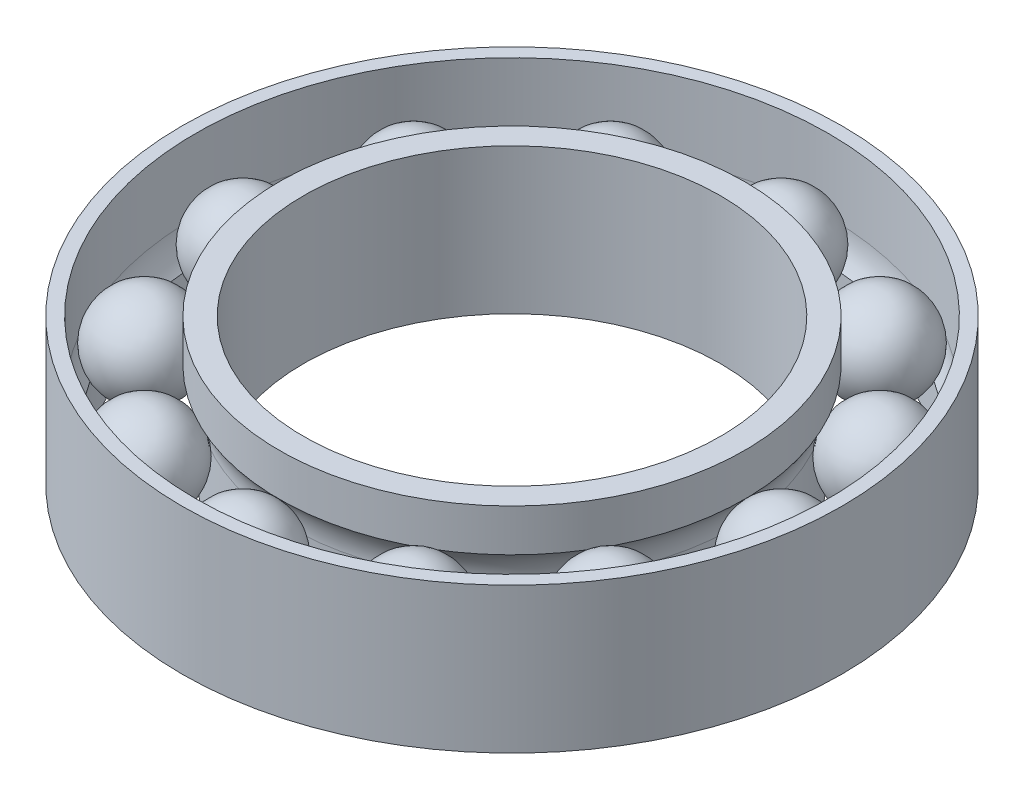
ISO-10303-21;
HEADER;
FILE_DESCRIPTION(('STEP AP214'),'2;1');
FILE_NAME('part.step','',(''),(''),'','','');
FILE_SCHEMA(('AUTOMOTIVE_DESIGN { 1 0 10303 214 1 1 1 1 }'));
ENDSEC;
DATA;
#1=APPLICATION_CONTEXT('core data for automotive mechanical design processes');
#2=APPLICATION_PROTOCOL_DEFINITION('international standard','automotive_design',2000,#1);
#3=PRODUCT_CONTEXT('',#1,'mechanical');
#4=PRODUCT('Part','Part','',(#3));
#5=PRODUCT_RELATED_PRODUCT_CATEGORY('part','',(#4));
#6=PRODUCT_DEFINITION_FORMATION('','',#4);
#7=PRODUCT_DEFINITION_CONTEXT('part definition',#1,'design');
#8=PRODUCT_DEFINITION('design','',#6,#7);
#9=PRODUCT_DEFINITION_SHAPE('','',#8);
#10=(LENGTH_UNIT() NAMED_UNIT(*) SI_UNIT(.MILLI.,.METRE.));
#11=(NAMED_UNIT(*) PLANE_ANGLE_UNIT() SI_UNIT($,.RADIAN.));
#12=(NAMED_UNIT(*) SI_UNIT($,.STERADIAN.) SOLID_ANGLE_UNIT());
#13=UNCERTAINTY_MEASURE_WITH_UNIT(LENGTH_MEASURE(1.E-05),#10,'distance_accuracy_value','');
#14=(GEOMETRIC_REPRESENTATION_CONTEXT(3) GLOBAL_UNCERTAINTY_ASSIGNED_CONTEXT((#13)) GLOBAL_UNIT_ASSIGNED_CONTEXT((#10,
#11,#12)) REPRESENTATION_CONTEXT('',''));
#15=CARTESIAN_POINT('',(0.,0.,0.));
#16=DIRECTION('',(0.,0.,1.));
#17=DIRECTION('',(1.,0.,0.));
#18=AXIS2_PLACEMENT_3D('',#15,#16,#17);
#19=CARTESIAN_POINT('',(4.80644099100367,1.5,-2.77499999999994));
#20=DIRECTION('',(0.,-1.,0.));
#21=DIRECTION('',(-0.866025403784445,0.,0.499999999999989));
#22=AXIS2_PLACEMENT_3D('',#19,#20,#21);
#23=SPHERICAL_SURFACE('',#22,0.975);
#24=CARTESIAN_POINT('',(4.80644099100367,0.524999999999999,-2.77499999999994));
#25=VERTEX_POINT('',#24);
#26=VERTEX_LOOP('',#25);
#27=FACE_BOUND('',#26,.T.);
#28=ADVANCED_FACE('F44',(#27),#23,.T.);
#29=CLOSED_SHELL('',(#28));
#30=MANIFOLD_SOLID_BREP('B2',#29);
#31=CARTESIAN_POINT('',(2.77500000000006,1.5,-4.8064409910036));
#32=DIRECTION('',(0.,-1.,0.));
#33=DIRECTION('',(-0.50000000000001,0.,0.866025403784433));
#34=AXIS2_PLACEMENT_3D('',#31,#32,#33);
#35=SPHERICAL_SURFACE('',#34,0.975);
#36=CARTESIAN_POINT('',(2.77500000000006,0.524999999999999,-4.8064409910036));
#37=VERTEX_POINT('',#36);
#38=VERTEX_LOOP('',#37);
#39=FACE_BOUND('',#38,.T.);
#40=ADVANCED_FACE('F63',(#39),#35,.T.);
#41=CLOSED_SHELL('',(#40));
#42=MANIFOLD_SOLID_BREP('B6',#41);
#43=CARTESIAN_POINT('',(0.,1.5,-5.55));
#44=DIRECTION('',(0.,-1.,0.));
#45=DIRECTION('',(0.,0.,1.));
#46=AXIS2_PLACEMENT_3D('',#43,#44,#45);
#47=SPHERICAL_SURFACE('',#46,0.975);
#48=CARTESIAN_POINT('',(0.,0.524999999999999,-5.55));
#49=VERTEX_POINT('',#48);
#50=VERTEX_LOOP('',#49);
#51=FACE_BOUND('',#50,.T.);
#52=ADVANCED_FACE('F82',(#51),#47,.T.);
#53=CLOSED_SHELL('',(#52));
#54=MANIFOLD_SOLID_BREP('B40',#53);
#55=CARTESIAN_POINT('',(-2.77499999999996,1.5,-4.80644099100366));
#56=DIRECTION('',(0.,-1.,0.));
#57=DIRECTION('',(0.499999999999992,0.,0.866025403784443));
#58=AXIS2_PLACEMENT_3D('',#55,#56,#57);
#59=SPHERICAL_SURFACE('',#58,0.975);
#60=CARTESIAN_POINT('',(-2.77499999999996,0.524999999999999,-4.80644099100366));
#61=VERTEX_POINT('',#60);
#62=VERTEX_LOOP('',#61);
#63=FACE_BOUND('',#62,.T.);
#64=ADVANCED_FACE('F101',(#63),#59,.T.);
#65=CLOSED_SHELL('',(#64));
#66=MANIFOLD_SOLID_BREP('B59',#65);
#67=CARTESIAN_POINT('',(-4.80644099100361,1.5,-2.77500000000004));
#68=DIRECTION('',(0.,-1.,0.));
#69=DIRECTION('',(0.866025403784435,0.,0.500000000000007));
#70=AXIS2_PLACEMENT_3D('',#67,#68,#69);
#71=SPHERICAL_SURFACE('',#70,0.975);
#72=CARTESIAN_POINT('',(-4.80644099100361,0.524999999999999,-2.77500000000004));
#73=VERTEX_POINT('',#72);
#74=VERTEX_LOOP('',#73);
#75=FACE_BOUND('',#74,.T.);
#76=ADVANCED_FACE('F120',(#75),#71,.T.);
#77=CLOSED_SHELL('',(#76));
#78=MANIFOLD_SOLID_BREP('B78',#77);
#79=CARTESIAN_POINT('',(-5.55,1.5,0.));
#80=DIRECTION('',(0.,-1.,0.));
#81=DIRECTION('',(1.,0.,0.));
#82=AXIS2_PLACEMENT_3D('',#79,#80,#81);
#83=SPHERICAL_SURFACE('',#82,0.975);
#84=CARTESIAN_POINT('',(-5.55,0.524999999999999,0.));
#85=VERTEX_POINT('',#84);
#86=VERTEX_LOOP('',#85);
#87=FACE_BOUND('',#86,.T.);
#88=ADVANCED_FACE('F139',(#87),#83,.T.);
#89=CLOSED_SHELL('',(#88));
#90=MANIFOLD_SOLID_BREP('B97',#89);
#91=CARTESIAN_POINT('',(-4.80644099100365,1.5,2.77499999999997));
#92=DIRECTION('',(0.,-1.,0.));
#93=DIRECTION('',(0.866025403784442,0.,-0.499999999999995));
#94=AXIS2_PLACEMENT_3D('',#91,#92,#93);
#95=SPHERICAL_SURFACE('',#94,0.975);
#96=CARTESIAN_POINT('',(-4.80644099100365,0.524999999999999,2.77499999999997));
#97=VERTEX_POINT('',#96);
#98=VERTEX_LOOP('',#97);
#99=FACE_BOUND('',#98,.T.);
#100=ADVANCED_FACE('F158',(#99),#95,.T.);
#101=CLOSED_SHELL('',(#100));
#102=MANIFOLD_SOLID_BREP('B116',#101);
#103=CARTESIAN_POINT('',(-2.77500000000002,1.5,4.80644099100362));
#104=DIRECTION('',(0.,-1.,0.));
#105=DIRECTION('',(0.500000000000004,0.,-0.866025403784436));
#106=AXIS2_PLACEMENT_3D('',#103,#104,#105);
#107=SPHERICAL_SURFACE('',#106,0.975);
#108=CARTESIAN_POINT('',(-2.77500000000002,0.524999999999999,4.80644099100362));
#109=VERTEX_POINT('',#108);
#110=VERTEX_LOOP('',#109);
#111=FACE_BOUND('',#110,.T.);
#112=ADVANCED_FACE('F177',(#111),#107,.T.);
#113=CLOSED_SHELL('',(#112));
#114=MANIFOLD_SOLID_BREP('B135',#113);
#115=CARTESIAN_POINT('',(0.,1.5,5.55));
#116=DIRECTION('',(0.,-1.,0.));
#117=DIRECTION('',(0.,0.,-1.));
#118=AXIS2_PLACEMENT_3D('',#115,#116,#117);
#119=SPHERICAL_SURFACE('',#118,0.975);
#120=CARTESIAN_POINT('',(0.,0.524999999999999,5.55));
#121=VERTEX_POINT('',#120);
#122=VERTEX_LOOP('',#121);
#123=FACE_BOUND('',#122,.T.);
#124=ADVANCED_FACE('F196',(#123),#119,.T.);
#125=CLOSED_SHELL('',(#124));
#126=MANIFOLD_SOLID_BREP('B154',#125);
#127=CARTESIAN_POINT('',(2.77499999999999,1.5,4.80644099100364));
#128=DIRECTION('',(0.,-1.,0.));
#129=DIRECTION('',(-0.499999999999998,0.,-0.86602540378444));
#130=AXIS2_PLACEMENT_3D('',#127,#128,#129);
#131=SPHERICAL_SURFACE('',#130,0.975);
#132=CARTESIAN_POINT('',(2.77499999999999,0.524999999999999,4.80644099100364));
#133=VERTEX_POINT('',#132);
#134=VERTEX_LOOP('',#133);
#135=FACE_BOUND('',#134,.T.);
#136=ADVANCED_FACE('F215',(#135),#131,.T.);
#137=CLOSED_SHELL('',(#136));
#138=MANIFOLD_SOLID_BREP('B173',#137);
#139=CARTESIAN_POINT('',(4.80644099100363,1.5,2.77500000000001));
#140=DIRECTION('',(0.,-1.,0.));
#141=DIRECTION('',(-0.866025403784438,0.,-0.500000000000001));
#142=AXIS2_PLACEMENT_3D('',#139,#140,#141);
#143=SPHERICAL_SURFACE('',#142,0.975);
#144=CARTESIAN_POINT('',(4.80644099100363,0.524999999999999,2.77500000000001));
#145=VERTEX_POINT('',#144);
#146=VERTEX_LOOP('',#145);
#147=FACE_BOUND('',#146,.T.);
#148=ADVANCED_FACE('F234',(#147),#143,.T.);
#149=CLOSED_SHELL('',(#148));
#150=MANIFOLD_SOLID_BREP('B192',#149);
#151=CARTESIAN_POINT('',(5.55,1.5,0.));
#152=DIRECTION('',(0.,-1.,0.));
#153=DIRECTION('',(-1.,0.,0.));
#154=AXIS2_PLACEMENT_3D('',#151,#152,#153);
#155=SPHERICAL_SURFACE('',#154,0.975);
#156=CARTESIAN_POINT('',(5.55,0.524999999999999,0.));
#157=VERTEX_POINT('',#156);
#158=VERTEX_LOOP('',#157);
#159=FACE_BOUND('',#158,.T.);
#160=ADVANCED_FACE('F255',(#159),#155,.T.);
#161=CLOSED_SHELL('',(#160));
#162=MANIFOLD_SOLID_BREP('B211',#161);
#163=CARTESIAN_POINT('',(6.3,0.,0.));
#164=DIRECTION('',(0.,-1.,0.));
#165=DIRECTION('',(0.,0.,-1.));
#166=AXIS2_PLACEMENT_3D('',#163,#164,#165);
#167=PLANE('',#166);
#168=CARTESIAN_POINT('',(0.,0.,0.));
#169=DIRECTION('',(0.,-1.,0.));
#170=DIRECTION('',(0.,0.,-1.));
#171=AXIS2_PLACEMENT_3D('',#168,#169,#170);
#172=CIRCLE('',#171,6.8);
#173=CARTESIAN_POINT('',(0.,0.,-6.8));
#174=VERTEX_POINT('',#173);
#175=EDGE_CURVE('E254',#174,#174,#172,.T.);
#176=ORIENTED_EDGE('',*,*,#175,.T.);
#177=EDGE_LOOP('',(#176));
#178=FACE_BOUND('',#177,.T.);
#179=CARTESIAN_POINT('',(0.,0.,0.));
#180=DIRECTION('',(0.,-1.,0.));
#181=DIRECTION('',(0.,0.,-1.));
#182=AXIS2_PLACEMENT_3D('',#179,#180,#181);
#183=CIRCLE('',#182,6.3);
#184=CARTESIAN_POINT('',(0.,0.,-6.3));
#185=VERTEX_POINT('',#184);
#186=EDGE_CURVE('E302',#185,#185,#183,.T.);
#187=ORIENTED_EDGE('',*,*,#186,.F.);
#188=EDGE_LOOP('',(#187));
#189=FACE_BOUND('',#188,.T.);
#190=ADVANCED_FACE('F275',(#178,#189),#167,.T.);
#191=CARTESIAN_POINT('',(0.,3.,0.));
#192=DIRECTION('',(0.,-1.,0.));
#193=DIRECTION('',(0.,0.,-1.));
#194=AXIS2_PLACEMENT_3D('',#191,#192,#193);
#195=CYLINDRICAL_SURFACE('',#194,6.8);
#196=CARTESIAN_POINT('',(0.,3.,0.));
#197=DIRECTION('',(0.,-1.,0.));
#198=DIRECTION('',(0.,0.,-1.));
#199=AXIS2_PLACEMENT_3D('',#196,#197,#198);
#200=CIRCLE('',#199,6.8);
#201=CARTESIAN_POINT('',(0.,3.,-6.8));
#202=VERTEX_POINT('',#201);
#203=EDGE_CURVE('E282',#202,#202,#200,.T.);
#204=ORIENTED_EDGE('',*,*,#203,.T.);
#205=EDGE_LOOP('',(#204));
#206=FACE_BOUND('',#205,.T.);
#207=ORIENTED_EDGE('',*,*,#175,.F.);
#208=EDGE_LOOP('',(#207));
#209=FACE_BOUND('',#208,.T.);
#210=ADVANCED_FACE('F311',(#206,#209),#195,.T.);
#211=CARTESIAN_POINT('',(6.8,3.,0.));
#212=DIRECTION('',(0.,1.,0.));
#213=DIRECTION('',(0.,0.,1.));
#214=AXIS2_PLACEMENT_3D('',#211,#212,#213);
#215=PLANE('',#214);
#216=CARTESIAN_POINT('',(0.,3.,0.));
#217=DIRECTION('',(0.,-1.,0.));
#218=DIRECTION('',(0.,0.,-1.));
#219=AXIS2_PLACEMENT_3D('',#216,#217,#218);
#220=CIRCLE('',#219,6.525);
#221=CARTESIAN_POINT('',(0.,3.,-6.525));
#222=VERTEX_POINT('',#221);
#223=EDGE_CURVE('E287',#222,#222,#220,.T.);
#224=ORIENTED_EDGE('',*,*,#223,.T.);
#225=EDGE_LOOP('',(#224));
#226=FACE_BOUND('',#225,.T.);
#227=ORIENTED_EDGE('',*,*,#203,.F.);
#228=EDGE_LOOP('',(#227));
#229=FACE_BOUND('',#228,.T.);
#230=ADVANCED_FACE('F315',(#226,#229),#215,.T.);
#231=CARTESIAN_POINT('',(0.,3.,0.));
#232=DIRECTION('',(0.,-1.,0.));
#233=DIRECTION('',(0.,0.,-1.));
#234=AXIS2_PLACEMENT_3D('',#231,#232,#233);
#235=CYLINDRICAL_SURFACE('',#234,6.525);
#236=CARTESIAN_POINT('',(0.,1.5049242264469,0.));
#237=DIRECTION('',(0.,-1.,0.));
#238=DIRECTION('',(0.,0.,-1.));
#239=AXIS2_PLACEMENT_3D('',#236,#237,#238);
#240=CIRCLE('',#239,6.525);
#241=CARTESIAN_POINT('',(0.,1.5049242264469,-6.525));
#242=VERTEX_POINT('',#241);
#243=EDGE_CURVE('E292',#242,#242,#240,.T.);
#244=ORIENTED_EDGE('',*,*,#243,.T.);
#245=EDGE_LOOP('',(#244));
#246=FACE_BOUND('',#245,.T.);
#247=ORIENTED_EDGE('',*,*,#223,.F.);
#248=EDGE_LOOP('',(#247));
#249=FACE_BOUND('',#248,.T.);
#250=ADVANCED_FACE('F319',(#246,#249),#235,.F.);
#251=CARTESIAN_POINT('',(0.,1.5049242264469,0.));
#252=DIRECTION('',(0.,-1.,0.));
#253=DIRECTION('',(0.,0.,-1.));
#254=AXIS2_PLACEMENT_3D('',#251,#252,#253);
#255=TOROIDAL_SURFACE('',#254,5.55,0.975);
#256=CARTESIAN_POINT('',(0.,0.881927436728043,0.));
#257=DIRECTION('',(0.,-1.,0.));
#258=DIRECTION('',(0.,0.,-1.));
#259=AXIS2_PLACEMENT_3D('',#256,#257,#258);
#260=CIRCLE('',#259,6.3);
#261=CARTESIAN_POINT('',(0.,0.881927436728043,-6.3));
#262=VERTEX_POINT('',#261);
#263=EDGE_CURVE('E298',#262,#262,#260,.T.);
#264=ORIENTED_EDGE('',*,*,#263,.T.);
#265=EDGE_LOOP('',(#264));
#266=FACE_BOUND('',#265,.T.);
#267=ORIENTED_EDGE('',*,*,#243,.F.);
#268=EDGE_LOOP('',(#267));
#269=FACE_BOUND('',#268,.T.);
#270=ADVANCED_FACE('F326',(#266,#269),#255,.F.);
#271=CARTESIAN_POINT('',(0.,3.,0.));
#272=DIRECTION('',(0.,-1.,0.));
#273=DIRECTION('',(0.,0.,-1.));
#274=AXIS2_PLACEMENT_3D('',#271,#272,#273);
#275=CYLINDRICAL_SURFACE('',#274,6.3);
#276=ORIENTED_EDGE('',*,*,#186,.T.);
#277=EDGE_LOOP('',(#276));
#278=FACE_BOUND('',#277,.T.);
#279=ORIENTED_EDGE('',*,*,#263,.F.);
#280=EDGE_LOOP('',(#279));
#281=FACE_BOUND('',#280,.T.);
#282=ADVANCED_FACE('F307',(#278,#281),#275,.F.);
#283=CLOSED_SHELL('',(#190,#210,#230,#250,#270,#282));
#284=MANIFOLD_SOLID_BREP('B230',#283);
#285=CARTESIAN_POINT('',(4.8,3.,0.));
#286=DIRECTION('',(0.,1.,0.));
#287=DIRECTION('',(0.,0.,1.));
#288=AXIS2_PLACEMENT_3D('',#285,#286,#287);
#289=PLANE('',#288);
#290=CARTESIAN_POINT('',(0.,3.,0.));
#291=DIRECTION('',(0.,-1.,0.));
#292=DIRECTION('',(0.,0.,-1.));
#293=AXIS2_PLACEMENT_3D('',#290,#291,#292);
#294=CIRCLE('',#293,4.3);
#295=CARTESIAN_POINT('',(0.,3.,-4.3));
#296=VERTEX_POINT('',#295);
#297=EDGE_CURVE('E274',#296,#296,#294,.T.);
#298=ORIENTED_EDGE('',*,*,#297,.T.);
#299=EDGE_LOOP('',(#298));
#300=FACE_BOUND('',#299,.T.);
#301=CARTESIAN_POINT('',(0.,3.,0.));
#302=DIRECTION('',(0.,-1.,0.));
#303=DIRECTION('',(0.,0.,-1.));
#304=AXIS2_PLACEMENT_3D('',#301,#302,#303);
#305=CIRCLE('',#304,4.8);
#306=CARTESIAN_POINT('',(0.,3.,-4.8));
#307=VERTEX_POINT('',#306);
#308=EDGE_CURVE('E395',#307,#307,#305,.T.);
#309=ORIENTED_EDGE('',*,*,#308,.F.);
#310=EDGE_LOOP('',(#309));
#311=FACE_BOUND('',#310,.T.);
#312=ADVANCED_FACE('F373',(#300,#311),#289,.T.);
#313=CARTESIAN_POINT('',(0.,3.,0.));
#314=DIRECTION('',(0.,-1.,0.));
#315=DIRECTION('',(0.,0.,-1.));
#316=AXIS2_PLACEMENT_3D('',#313,#314,#315);
#317=CYLINDRICAL_SURFACE('',#316,4.3);
#318=CARTESIAN_POINT('',(0.,0.,0.));
#319=DIRECTION('',(0.,-1.,0.));
#320=DIRECTION('',(0.,0.,-1.));
#321=AXIS2_PLACEMENT_3D('',#318,#319,#320);
#322=CIRCLE('',#321,4.3);
#323=CARTESIAN_POINT('',(0.,0.,-4.3));
#324=VERTEX_POINT('',#323);
#325=EDGE_CURVE('E379',#324,#324,#322,.T.);
#326=ORIENTED_EDGE('',*,*,#325,.T.);
#327=EDGE_LOOP('',(#326));
#328=FACE_BOUND('',#327,.T.);
#329=ORIENTED_EDGE('',*,*,#297,.F.);
#330=EDGE_LOOP('',(#329));
#331=FACE_BOUND('',#330,.T.);
#332=ADVANCED_FACE('F403',(#328,#331),#317,.F.);
#333=CARTESIAN_POINT('',(4.3,0.,0.));
#334=DIRECTION('',(0.,-1.,0.));
#335=DIRECTION('',(0.,0.,-1.));
#336=AXIS2_PLACEMENT_3D('',#333,#334,#335);
#337=PLANE('',#336);
#338=CARTESIAN_POINT('',(0.,0.,0.));
#339=DIRECTION('',(0.,-1.,0.));
#340=DIRECTION('',(0.,0.,-1.));
#341=AXIS2_PLACEMENT_3D('',#338,#339,#340);
#342=CIRCLE('',#341,4.575);
#343=CARTESIAN_POINT('',(0.,0.,-4.575));
#344=VERTEX_POINT('',#343);
#345=EDGE_CURVE('E383',#344,#344,#342,.T.);
#346=ORIENTED_EDGE('',*,*,#345,.T.);
#347=EDGE_LOOP('',(#346));
#348=FACE_BOUND('',#347,.T.);
#349=ORIENTED_EDGE('',*,*,#325,.F.);
#350=EDGE_LOOP('',(#349));
#351=FACE_BOUND('',#350,.T.);
#352=ADVANCED_FACE('F407',(#348,#351),#337,.T.);
#353=CARTESIAN_POINT('',(0.,3.,0.));
#354=DIRECTION('',(0.,-1.,0.));
#355=DIRECTION('',(0.,0.,-1.));
#356=AXIS2_PLACEMENT_3D('',#353,#354,#355);
#357=CYLINDRICAL_SURFACE('',#356,4.575);
#358=CARTESIAN_POINT('',(0.,1.5049242264469,0.));
#359=DIRECTION('',(0.,-1.,0.));
#360=DIRECTION('',(0.,0.,-1.));
#361=AXIS2_PLACEMENT_3D('',#358,#359,#360);
#362=CIRCLE('',#361,4.575);
#363=CARTESIAN_POINT('',(0.,1.5049242264469,-4.575));
#364=VERTEX_POINT('',#363);
#365=EDGE_CURVE('E387',#364,#364,#362,.T.);
#366=ORIENTED_EDGE('',*,*,#365,.T.);
#367=EDGE_LOOP('',(#366));
#368=FACE_BOUND('',#367,.T.);
#369=ORIENTED_EDGE('',*,*,#345,.F.);
#370=EDGE_LOOP('',(#369));
#371=FACE_BOUND('',#370,.T.);
#372=ADVANCED_FACE('F411',(#368,#371),#357,.T.);
#373=CARTESIAN_POINT('',(0.,1.5049242264469,0.));
#374=DIRECTION('',(0.,-1.,0.));
#375=DIRECTION('',(0.,0.,-1.));
#376=AXIS2_PLACEMENT_3D('',#373,#374,#375);
#377=TOROIDAL_SURFACE('',#376,5.55,0.975);
#378=CARTESIAN_POINT('',(0.,2.12792101616576,0.));
#379=DIRECTION('',(0.,-1.,0.));
#380=DIRECTION('',(0.,0.,-1.));
#381=AXIS2_PLACEMENT_3D('',#378,#379,#380);
#382=CIRCLE('',#381,4.8);
#383=CARTESIAN_POINT('',(0.,2.12792101616576,-4.8));
#384=VERTEX_POINT('',#383);
#385=EDGE_CURVE('E392',#384,#384,#382,.T.);
#386=ORIENTED_EDGE('',*,*,#385,.T.);
#387=EDGE_LOOP('',(#386));
#388=FACE_BOUND('',#387,.T.);
#389=ORIENTED_EDGE('',*,*,#365,.F.);
#390=EDGE_LOOP('',(#389));
#391=FACE_BOUND('',#390,.T.);
#392=ADVANCED_FACE('F418',(#388,#391),#377,.F.);
#393=CARTESIAN_POINT('',(0.,3.,0.));
#394=DIRECTION('',(0.,-1.,0.));
#395=DIRECTION('',(0.,0.,-1.));
#396=AXIS2_PLACEMENT_3D('',#393,#394,#395);
#397=CYLINDRICAL_SURFACE('',#396,4.8);
#398=ORIENTED_EDGE('',*,*,#308,.T.);
#399=EDGE_LOOP('',(#398));
#400=FACE_BOUND('',#399,.T.);
#401=ORIENTED_EDGE('',*,*,#385,.F.);
#402=EDGE_LOOP('',(#401));
#403=FACE_BOUND('',#402,.T.);
#404=ADVANCED_FACE('F399',(#400,#403),#397,.T.);
#405=CLOSED_SHELL('',(#312,#332,#352,#372,#392,#404));
#406=MANIFOLD_SOLID_BREP('B249',#405);
#407=ADVANCED_BREP_SHAPE_REPRESENTATION('',(#18,#30,#42,#54,#66,#78,#90,#102,#114,#126,#138,
#150,#162,#284,#406),#14);
#408=SHAPE_DEFINITION_REPRESENTATION(#9,#407);
ENDSEC;
END-ISO-10303-21;
